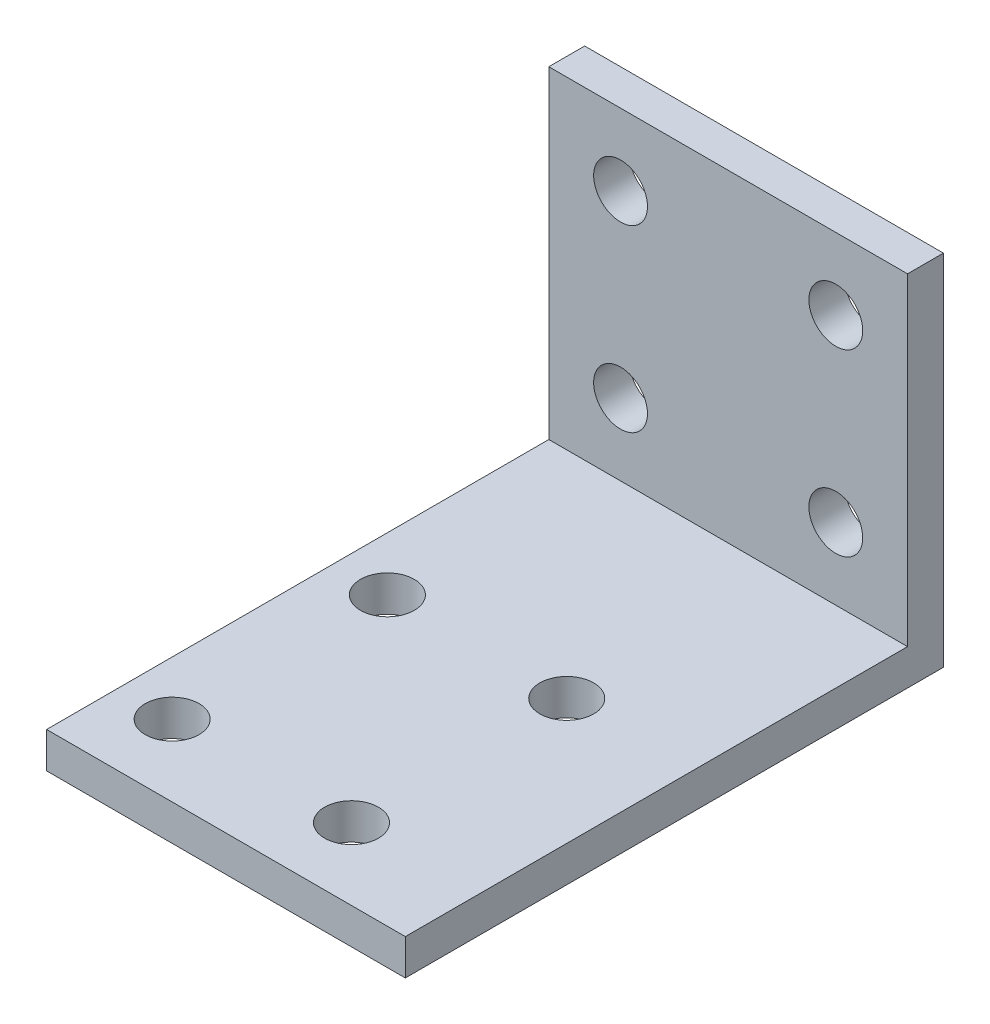
ISO-10303-21;
HEADER;
FILE_DESCRIPTION(('STEP AP214'),'2;1');
FILE_NAME('part.step','',(''),(''),'','','');
FILE_SCHEMA(('AUTOMOTIVE_DESIGN { 1 0 10303 214 1 1 1 1 }'));
ENDSEC;
DATA;
#1=APPLICATION_CONTEXT('core data for automotive mechanical design processes');
#2=APPLICATION_PROTOCOL_DEFINITION('international standard','automotive_design',2000,#1);
#3=PRODUCT_CONTEXT('',#1,'mechanical');
#4=PRODUCT('Part','Part','',(#3));
#5=PRODUCT_RELATED_PRODUCT_CATEGORY('part','',(#4));
#6=PRODUCT_DEFINITION_FORMATION('','',#4);
#7=PRODUCT_DEFINITION_CONTEXT('part definition',#1,'design');
#8=PRODUCT_DEFINITION('design','',#6,#7);
#9=PRODUCT_DEFINITION_SHAPE('','',#8);
#10=(LENGTH_UNIT() NAMED_UNIT(*) SI_UNIT(.MILLI.,.METRE.));
#11=(NAMED_UNIT(*) PLANE_ANGLE_UNIT() SI_UNIT($,.RADIAN.));
#12=(NAMED_UNIT(*) SI_UNIT($,.STERADIAN.) SOLID_ANGLE_UNIT());
#13=UNCERTAINTY_MEASURE_WITH_UNIT(LENGTH_MEASURE(1.E-05),#10,'distance_accuracy_value','');
#14=(GEOMETRIC_REPRESENTATION_CONTEXT(3) GLOBAL_UNCERTAINTY_ASSIGNED_CONTEXT((#13)) GLOBAL_UNIT_ASSIGNED_CONTEXT((#10,
#11,#12)) REPRESENTATION_CONTEXT('',''));
#15=CARTESIAN_POINT('',(0.,0.,0.));
#16=DIRECTION('',(0.,0.,1.));
#17=DIRECTION('',(1.,0.,0.));
#18=AXIS2_PLACEMENT_3D('',#15,#16,#17);
#19=CARTESIAN_POINT('',(0.,20.,0.));
#20=DIRECTION('',(0.,1.,0.));
#21=DIRECTION('',(0.,0.,1.));
#22=AXIS2_PLACEMENT_3D('',#19,#20,#21);
#23=PLANE('',#22);
#24=DIRECTION('',(0.,0.,1.));
#25=VECTOR('',#24,1.);
#26=CARTESIAN_POINT('',(-21.3353115727003,20.,-6.91394658753707));
#27=LINE('',#26,#25);
#28=CARTESIAN_POINT('',(-21.3353115727003,20.,-6.91394658753707));
#29=VERTEX_POINT('',#28);
#30=CARTESIAN_POINT('',(-21.3353115727003,20.,-4.91394658753707));
#31=VERTEX_POINT('',#30);
#32=EDGE_CURVE('E135',#29,#31,#27,.T.);
#33=ORIENTED_EDGE('',*,*,#32,.T.);
#34=DIRECTION('',(-1.,0.,0.));
#35=VECTOR('',#34,1.);
#36=CARTESIAN_POINT('',(-21.3353115727003,20.,-4.91394658753707));
#37=LINE('',#36,#35);
#38=CARTESIAN_POINT('',(-1.33531157270029,20.,-4.91394658753707));
#39=VERTEX_POINT('',#38);
#40=EDGE_CURVE('E100',#39,#31,#37,.T.);
#41=ORIENTED_EDGE('',*,*,#40,.F.);
#42=DIRECTION('',(0.,0.,1.));
#43=VECTOR('',#42,1.);
#44=CARTESIAN_POINT('',(-1.33531157270029,20.,0.));
#45=LINE('',#44,#43);
#46=CARTESIAN_POINT('',(-1.33531157270029,20.,-6.91394658753707));
#47=VERTEX_POINT('',#46);
#48=EDGE_CURVE('E99',#47,#39,#45,.T.);
#49=ORIENTED_EDGE('',*,*,#48,.F.);
#50=DIRECTION('',(-1.,0.,0.));
#51=VECTOR('',#50,1.);
#52=CARTESIAN_POINT('',(-21.3353115727003,20.,-6.91394658753707));
#53=LINE('',#52,#51);
#54=EDGE_CURVE('E138',#47,#29,#53,.T.);
#55=ORIENTED_EDGE('',*,*,#54,.T.);
#56=EDGE_LOOP('',(#33,#41,#49,#55));
#57=FACE_BOUND('',#56,.T.);
#58=ADVANCED_FACE('F39',(#57),#23,.T.);
#59=CARTESIAN_POINT('',(0.,0.,0.));
#60=DIRECTION('',(0.,1.,0.));
#61=DIRECTION('',(0.,0.,1.));
#62=AXIS2_PLACEMENT_3D('',#59,#60,#61);
#63=PLANE('',#62);
#64=CARTESIAN_POINT('',(-8.33531157270018,0.,19.0860534124648));
#65=DIRECTION('',(0.,-1.,0.));
#66=DIRECTION('',(0.,0.,-1.));
#67=AXIS2_PLACEMENT_3D('',#64,#65,#66);
#68=CIRCLE('',#67,1.5);
#69=CARTESIAN_POINT('',(-8.33531157270018,0.,17.5860534124648));
#70=VERTEX_POINT('',#69);
#71=EDGE_CURVE('E319',#70,#70,#68,.T.);
#72=ORIENTED_EDGE('',*,*,#71,.F.);
#73=EDGE_LOOP('',(#72));
#74=FACE_BOUND('',#73,.T.);
#75=CARTESIAN_POINT('',(-18.3353115727002,0.,7.08605341246484));
#76=DIRECTION('',(0.,-1.,0.));
#77=DIRECTION('',(0.,0.,-1.));
#78=AXIS2_PLACEMENT_3D('',#75,#76,#77);
#79=CIRCLE('',#78,1.5);
#80=CARTESIAN_POINT('',(-18.3353115727002,0.,5.58605341246483));
#81=VERTEX_POINT('',#80);
#82=EDGE_CURVE('E314',#81,#81,#79,.T.);
#83=ORIENTED_EDGE('',*,*,#82,.F.);
#84=EDGE_LOOP('',(#83));
#85=FACE_BOUND('',#84,.T.);
#86=CARTESIAN_POINT('',(-18.3353115727002,0.,19.0860534124648));
#87=DIRECTION('',(0.,-1.,0.));
#88=DIRECTION('',(0.,0.,-1.));
#89=AXIS2_PLACEMENT_3D('',#86,#87,#88);
#90=CIRCLE('',#89,1.5);
#91=CARTESIAN_POINT('',(-18.3353115727002,0.,17.5860534124648));
#92=VERTEX_POINT('',#91);
#93=EDGE_CURVE('E311',#92,#92,#90,.T.);
#94=ORIENTED_EDGE('',*,*,#93,.F.);
#95=EDGE_LOOP('',(#94));
#96=FACE_BOUND('',#95,.T.);
#97=CARTESIAN_POINT('',(-8.33531157270017,0.,7.08605341246484));
#98=DIRECTION('',(0.,-1.,0.));
#99=DIRECTION('',(0.,0.,-1.));
#100=AXIS2_PLACEMENT_3D('',#97,#98,#99);
#101=CIRCLE('',#100,1.5);
#102=CARTESIAN_POINT('',(-8.33531157270017,0.,5.58605341246483));
#103=VERTEX_POINT('',#102);
#104=EDGE_CURVE('E118',#103,#103,#101,.T.);
#105=ORIENTED_EDGE('',*,*,#104,.F.);
#106=EDGE_LOOP('',(#105));
#107=FACE_BOUND('',#106,.T.);
#108=DIRECTION('',(1.,0.,0.));
#109=VECTOR('',#108,1.);
#110=CARTESIAN_POINT('',(-21.3353115727003,0.,23.0860534124629));
#111=LINE('',#110,#109);
#112=CARTESIAN_POINT('',(-21.3353115727003,0.,23.0860534124629));
#113=VERTEX_POINT('',#112);
#114=CARTESIAN_POINT('',(-1.33531157270028,0.,23.0860534124629));
#115=VERTEX_POINT('',#114);
#116=EDGE_CURVE('E64',#113,#115,#111,.T.);
#117=ORIENTED_EDGE('',*,*,#116,.F.);
#118=DIRECTION('',(0.,0.,1.));
#119=VECTOR('',#118,1.);
#120=CARTESIAN_POINT('',(-21.3353115727003,0.,-6.91394658753707));
#121=LINE('',#120,#119);
#122=CARTESIAN_POINT('',(-21.3353115727003,0.,-6.91394658753707));
#123=VERTEX_POINT('',#122);
#124=EDGE_CURVE('E140',#123,#113,#121,.T.);
#125=ORIENTED_EDGE('',*,*,#124,.F.);
#126=DIRECTION('',(-1.,0.,0.));
#127=VECTOR('',#126,1.);
#128=CARTESIAN_POINT('',(-21.3353115727003,0.,-6.91394658753707));
#129=LINE('',#128,#127);
#130=CARTESIAN_POINT('',(-1.33531157270029,0.,-6.91394658753707));
#131=VERTEX_POINT('',#130);
#132=EDGE_CURVE('E48',#131,#123,#129,.T.);
#133=ORIENTED_EDGE('',*,*,#132,.F.);
#134=DIRECTION('',(0.,0.,-1.));
#135=VECTOR('',#134,1.);
#136=CARTESIAN_POINT('',(-1.33531157270029,0.,0.));
#137=LINE('',#136,#135);
#138=EDGE_CURVE('E130',#115,#131,#137,.T.);
#139=ORIENTED_EDGE('',*,*,#138,.F.);
#140=EDGE_LOOP('',(#117,#125,#133,#139));
#141=FACE_BOUND('',#140,.T.);
#142=ADVANCED_FACE('F173',(#74,#85,#96,#107,#141),#63,.F.);
#143=CARTESIAN_POINT('',(-21.3353115727003,3.,-6.91394658753707));
#144=DIRECTION('',(1.,0.,0.));
#145=DIRECTION('',(0.,0.,-1.));
#146=AXIS2_PLACEMENT_3D('',#143,#144,#145);
#147=PLANE('',#146);
#148=DIRECTION('',(0.,0.,1.));
#149=VECTOR('',#148,1.);
#150=CARTESIAN_POINT('',(-21.3353115727003,2.,-4.91394658753707));
#151=LINE('',#150,#149);
#152=CARTESIAN_POINT('',(-21.3353115727003,2.,-4.91394658753707));
#153=VERTEX_POINT('',#152);
#154=CARTESIAN_POINT('',(-21.3353115727003,2.,23.0860534124629));
#155=VERTEX_POINT('',#154);
#156=EDGE_CURVE('E109',#153,#155,#151,.T.);
#157=ORIENTED_EDGE('',*,*,#156,.F.);
#158=DIRECTION('',(0.,-1.,0.));
#159=VECTOR('',#158,1.);
#160=CARTESIAN_POINT('',(-21.3353115727003,20.,-4.91394658753707));
#161=LINE('',#160,#159);
#162=EDGE_CURVE('E101',#31,#153,#161,.T.);
#163=ORIENTED_EDGE('',*,*,#162,.F.);
#164=ORIENTED_EDGE('',*,*,#32,.F.);
#165=DIRECTION('',(0.,-1.,0.));
#166=VECTOR('',#165,1.);
#167=CARTESIAN_POINT('',(-21.3353115727003,3.,-6.91394658753707));
#168=LINE('',#167,#166);
#169=EDGE_CURVE('E11',#29,#123,#168,.T.);
#170=ORIENTED_EDGE('',*,*,#169,.T.);
#171=ORIENTED_EDGE('',*,*,#124,.T.);
#172=DIRECTION('',(0.,-1.,0.));
#173=VECTOR('',#172,1.);
#174=CARTESIAN_POINT('',(-21.3353115727003,3.,23.0860534124629));
#175=LINE('',#174,#173);
#176=EDGE_CURVE('E125',#155,#113,#175,.T.);
#177=ORIENTED_EDGE('',*,*,#176,.F.);
#178=EDGE_LOOP('',(#157,#163,#164,#170,#171,#177));
#179=FACE_BOUND('',#178,.T.);
#180=ADVANCED_FACE('F41',(#179),#147,.F.);
#181=CARTESIAN_POINT('',(-1.33531157270029,0.,0.));
#182=DIRECTION('',(1.,0.,0.));
#183=DIRECTION('',(0.,0.,-1.));
#184=AXIS2_PLACEMENT_3D('',#181,#182,#183);
#185=PLANE('',#184);
#186=DIRECTION('',(0.,1.,0.));
#187=VECTOR('',#186,1.);
#188=CARTESIAN_POINT('',(-1.33531157270029,20.,-4.91394658753707));
#189=LINE('',#188,#187);
#190=CARTESIAN_POINT('',(-1.33531157270029,2.,-4.91394658753707));
#191=VERTEX_POINT('',#190);
#192=EDGE_CURVE('E56',#191,#39,#189,.T.);
#193=ORIENTED_EDGE('',*,*,#192,.F.);
#194=DIRECTION('',(0.,0.,-1.));
#195=VECTOR('',#194,1.);
#196=CARTESIAN_POINT('',(-1.33531157270029,2.,-4.91394658753707));
#197=LINE('',#196,#195);
#198=CARTESIAN_POINT('',(-1.33531157270029,2.,23.0860534124629));
#199=VERTEX_POINT('',#198);
#200=EDGE_CURVE('E97',#199,#191,#197,.T.);
#201=ORIENTED_EDGE('',*,*,#200,.F.);
#202=DIRECTION('',(0.,1.,0.));
#203=VECTOR('',#202,1.);
#204=CARTESIAN_POINT('',(-1.33531157270028,3.,23.0860534124629));
#205=LINE('',#204,#203);
#206=EDGE_CURVE('E128',#115,#199,#205,.T.);
#207=ORIENTED_EDGE('',*,*,#206,.F.);
#208=ORIENTED_EDGE('',*,*,#138,.T.);
#209=DIRECTION('',(0.,1.,0.));
#210=VECTOR('',#209,1.);
#211=CARTESIAN_POINT('',(-1.33531157270029,0.,-6.91394658753707));
#212=LINE('',#211,#210);
#213=EDGE_CURVE('E132',#131,#47,#212,.T.);
#214=ORIENTED_EDGE('',*,*,#213,.T.);
#215=ORIENTED_EDGE('',*,*,#48,.T.);
#216=EDGE_LOOP('',(#193,#201,#207,#208,#214,#215));
#217=FACE_BOUND('',#216,.T.);
#218=ADVANCED_FACE('F95',(#217),#185,.T.);
#219=CARTESIAN_POINT('',(-21.3353115727003,3.,-6.91394658753707));
#220=DIRECTION('',(0.,0.,1.));
#221=DIRECTION('',(1.,0.,0.));
#222=AXIS2_PLACEMENT_3D('',#219,#220,#221);
#223=PLANE('',#222);
#224=CARTESIAN_POINT('',(-17.3353115727003,6.,-6.91394658753707));
#225=DIRECTION('',(0.,0.,1.));
#226=DIRECTION('',(1.,0.,0.));
#227=AXIS2_PLACEMENT_3D('',#224,#225,#226);
#228=CIRCLE('',#227,1.5);
#229=CARTESIAN_POINT('',(-15.8353115727003,6.,-6.91394658753707));
#230=VERTEX_POINT('',#229);
#231=EDGE_CURVE('E197',#230,#230,#228,.T.);
#232=ORIENTED_EDGE('',*,*,#231,.T.);
#233=EDGE_LOOP('',(#232));
#234=FACE_BOUND('',#233,.T.);
#235=CARTESIAN_POINT('',(-5.33531157270029,16.,-6.91394658753707));
#236=DIRECTION('',(0.,0.,1.));
#237=DIRECTION('',(1.,0.,0.));
#238=AXIS2_PLACEMENT_3D('',#235,#236,#237);
#239=CIRCLE('',#238,1.5);
#240=CARTESIAN_POINT('',(-3.83531157270028,16.,-6.91394658753707));
#241=VERTEX_POINT('',#240);
#242=EDGE_CURVE('E201',#241,#241,#239,.T.);
#243=ORIENTED_EDGE('',*,*,#242,.T.);
#244=EDGE_LOOP('',(#243));
#245=FACE_BOUND('',#244,.T.);
#246=CARTESIAN_POINT('',(-17.3353115727003,16.,-6.91394658753707));
#247=DIRECTION('',(0.,0.,1.));
#248=DIRECTION('',(1.,0.,0.));
#249=AXIS2_PLACEMENT_3D('',#246,#247,#248);
#250=CIRCLE('',#249,1.5);
#251=CARTESIAN_POINT('',(-15.8353115727003,16.,-6.91394658753707));
#252=VERTEX_POINT('',#251);
#253=EDGE_CURVE('E205',#252,#252,#250,.T.);
#254=ORIENTED_EDGE('',*,*,#253,.T.);
#255=EDGE_LOOP('',(#254));
#256=FACE_BOUND('',#255,.T.);
#257=CARTESIAN_POINT('',(-5.33531157270029,6.,-6.91394658753707));
#258=DIRECTION('',(0.,0.,1.));
#259=DIRECTION('',(1.,0.,0.));
#260=AXIS2_PLACEMENT_3D('',#257,#258,#259);
#261=CIRCLE('',#260,1.5);
#262=CARTESIAN_POINT('',(-3.83531157270028,6.,-6.91394658753707));
#263=VERTEX_POINT('',#262);
#264=EDGE_CURVE('E209',#263,#263,#261,.T.);
#265=ORIENTED_EDGE('',*,*,#264,.T.);
#266=EDGE_LOOP('',(#265));
#267=FACE_BOUND('',#266,.T.);
#268=ORIENTED_EDGE('',*,*,#213,.F.);
#269=ORIENTED_EDGE('',*,*,#132,.T.);
#270=ORIENTED_EDGE('',*,*,#169,.F.);
#271=ORIENTED_EDGE('',*,*,#54,.F.);
#272=EDGE_LOOP('',(#268,#269,#270,#271));
#273=FACE_BOUND('',#272,.T.);
#274=ADVANCED_FACE('F184',(#234,#245,#256,#267,#273),#223,.F.);
#275=CARTESIAN_POINT('',(0.,0.,23.0860534124629));
#276=DIRECTION('',(0.,0.,1.));
#277=DIRECTION('',(1.,0.,0.));
#278=AXIS2_PLACEMENT_3D('',#275,#276,#277);
#279=PLANE('',#278);
#280=DIRECTION('',(1.,0.,0.));
#281=VECTOR('',#280,1.);
#282=CARTESIAN_POINT('',(-1.33531157270029,2.,23.0860534124629));
#283=LINE('',#282,#281);
#284=EDGE_CURVE('E113',#155,#199,#283,.T.);
#285=ORIENTED_EDGE('',*,*,#284,.F.);
#286=ORIENTED_EDGE('',*,*,#176,.T.);
#287=ORIENTED_EDGE('',*,*,#116,.T.);
#288=ORIENTED_EDGE('',*,*,#206,.T.);
#289=EDGE_LOOP('',(#285,#286,#287,#288));
#290=FACE_BOUND('',#289,.T.);
#291=ADVANCED_FACE('F186',(#290),#279,.T.);
#292=CARTESIAN_POINT('',(0.,0.,-4.91394658753707));
#293=DIRECTION('',(0.,0.,1.));
#294=DIRECTION('',(1.,0.,0.));
#295=AXIS2_PLACEMENT_3D('',#292,#293,#294);
#296=PLANE('',#295);
#297=CARTESIAN_POINT('',(-17.3353115727003,6.,-4.91394658753707));
#298=DIRECTION('',(0.,0.,1.));
#299=DIRECTION('',(1.,0.,0.));
#300=AXIS2_PLACEMENT_3D('',#297,#298,#299);
#301=CIRCLE('',#300,1.5);
#302=CARTESIAN_POINT('',(-15.8353115727003,6.,-4.91394658753707));
#303=VERTEX_POINT('',#302);
#304=EDGE_CURVE('E310',#303,#303,#301,.T.);
#305=ORIENTED_EDGE('',*,*,#304,.F.);
#306=EDGE_LOOP('',(#305));
#307=FACE_BOUND('',#306,.T.);
#308=CARTESIAN_POINT('',(-5.33531157270029,16.,-4.91394658753707));
#309=DIRECTION('',(0.,0.,1.));
#310=DIRECTION('',(1.,0.,0.));
#311=AXIS2_PLACEMENT_3D('',#308,#309,#310);
#312=CIRCLE('',#311,1.5);
#313=CARTESIAN_POINT('',(-3.83531157270028,16.,-4.91394658753707));
#314=VERTEX_POINT('',#313);
#315=EDGE_CURVE('E341',#314,#314,#312,.T.);
#316=ORIENTED_EDGE('',*,*,#315,.F.);
#317=EDGE_LOOP('',(#316));
#318=FACE_BOUND('',#317,.T.);
#319=CARTESIAN_POINT('',(-17.3353115727003,16.,-4.91394658753707));
#320=DIRECTION('',(0.,0.,1.));
#321=DIRECTION('',(1.,0.,0.));
#322=AXIS2_PLACEMENT_3D('',#319,#320,#321);
#323=CIRCLE('',#322,1.5);
#324=CARTESIAN_POINT('',(-15.8353115727003,16.,-4.91394658753707));
#325=VERTEX_POINT('',#324);
#326=EDGE_CURVE('E344',#325,#325,#323,.T.);
#327=ORIENTED_EDGE('',*,*,#326,.F.);
#328=EDGE_LOOP('',(#327));
#329=FACE_BOUND('',#328,.T.);
#330=CARTESIAN_POINT('',(-5.33531157270029,6.,-4.91394658753707));
#331=DIRECTION('',(0.,0.,1.));
#332=DIRECTION('',(1.,0.,0.));
#333=AXIS2_PLACEMENT_3D('',#330,#331,#332);
#334=CIRCLE('',#333,1.5);
#335=CARTESIAN_POINT('',(-3.83531157270028,6.,-4.91394658753707));
#336=VERTEX_POINT('',#335);
#337=EDGE_CURVE('E338',#336,#336,#334,.T.);
#338=ORIENTED_EDGE('',*,*,#337,.F.);
#339=EDGE_LOOP('',(#338));
#340=FACE_BOUND('',#339,.T.);
#341=ORIENTED_EDGE('',*,*,#162,.T.);
#342=DIRECTION('',(-1.,0.,0.));
#343=VECTOR('',#342,1.);
#344=CARTESIAN_POINT('',(-1.33531157270029,2.,-4.91394658753707));
#345=LINE('',#344,#343);
#346=EDGE_CURVE('E104',#191,#153,#345,.T.);
#347=ORIENTED_EDGE('',*,*,#346,.F.);
#348=ORIENTED_EDGE('',*,*,#192,.T.);
#349=ORIENTED_EDGE('',*,*,#40,.T.);
#350=EDGE_LOOP('',(#341,#347,#348,#349));
#351=FACE_BOUND('',#350,.T.);
#352=ADVANCED_FACE('F105',(#307,#318,#329,#340,#351),#296,.T.);
#353=CARTESIAN_POINT('',(0.,2.,0.));
#354=DIRECTION('',(0.,-1.,0.));
#355=DIRECTION('',(0.,0.,-1.));
#356=AXIS2_PLACEMENT_3D('',#353,#354,#355);
#357=PLANE('',#356);
#358=CARTESIAN_POINT('',(-8.33531157270018,2.,19.0860534124648));
#359=DIRECTION('',(0.,-1.,0.));
#360=DIRECTION('',(0.,0.,-1.));
#361=AXIS2_PLACEMENT_3D('',#358,#359,#360);
#362=CIRCLE('',#361,1.5);
#363=CARTESIAN_POINT('',(-8.33531157270018,2.,17.5860534124648));
#364=VERTEX_POINT('',#363);
#365=EDGE_CURVE('E43',#364,#364,#362,.T.);
#366=ORIENTED_EDGE('',*,*,#365,.T.);
#367=EDGE_LOOP('',(#366));
#368=FACE_BOUND('',#367,.T.);
#369=CARTESIAN_POINT('',(-18.3353115727002,2.,7.08605341246484));
#370=DIRECTION('',(0.,-1.,0.));
#371=DIRECTION('',(0.,0.,-1.));
#372=AXIS2_PLACEMENT_3D('',#369,#370,#371);
#373=CIRCLE('',#372,1.5);
#374=CARTESIAN_POINT('',(-18.3353115727002,2.,5.58605341246483));
#375=VERTEX_POINT('',#374);
#376=EDGE_CURVE('E116',#375,#375,#373,.T.);
#377=ORIENTED_EDGE('',*,*,#376,.T.);
#378=EDGE_LOOP('',(#377));
#379=FACE_BOUND('',#378,.T.);
#380=CARTESIAN_POINT('',(-18.3353115727002,2.,19.0860534124648));
#381=DIRECTION('',(0.,-1.,0.));
#382=DIRECTION('',(0.,0.,-1.));
#383=AXIS2_PLACEMENT_3D('',#380,#381,#382);
#384=CIRCLE('',#383,1.5);
#385=CARTESIAN_POINT('',(-18.3353115727002,2.,17.5860534124648));
#386=VERTEX_POINT('',#385);
#387=EDGE_CURVE('E147',#386,#386,#384,.T.);
#388=ORIENTED_EDGE('',*,*,#387,.T.);
#389=EDGE_LOOP('',(#388));
#390=FACE_BOUND('',#389,.T.);
#391=CARTESIAN_POINT('',(-8.33531157270017,2.,7.08605341246484));
#392=DIRECTION('',(0.,-1.,0.));
#393=DIRECTION('',(0.,0.,-1.));
#394=AXIS2_PLACEMENT_3D('',#391,#392,#393);
#395=CIRCLE('',#394,1.5);
#396=CARTESIAN_POINT('',(-8.33531157270017,2.,5.58605341246483));
#397=VERTEX_POINT('',#396);
#398=EDGE_CURVE('E144',#397,#397,#395,.T.);
#399=ORIENTED_EDGE('',*,*,#398,.T.);
#400=EDGE_LOOP('',(#399));
#401=FACE_BOUND('',#400,.T.);
#402=ORIENTED_EDGE('',*,*,#200,.T.);
#403=ORIENTED_EDGE('',*,*,#346,.T.);
#404=ORIENTED_EDGE('',*,*,#156,.T.);
#405=ORIENTED_EDGE('',*,*,#284,.T.);
#406=EDGE_LOOP('',(#402,#403,#404,#405));
#407=FACE_BOUND('',#406,.T.);
#408=ADVANCED_FACE('F111',(#368,#379,#390,#401,#407),#357,.F.);
#409=CARTESIAN_POINT('',(-8.33531157270017,10.,7.08605341246484));
#410=DIRECTION('',(0.,-1.,0.));
#411=DIRECTION('',(0.,0.,-1.));
#412=AXIS2_PLACEMENT_3D('',#409,#410,#411);
#413=CYLINDRICAL_SURFACE('',#412,1.5);
#414=ORIENTED_EDGE('',*,*,#104,.T.);
#415=EDGE_LOOP('',(#414));
#416=FACE_BOUND('',#415,.T.);
#417=ORIENTED_EDGE('',*,*,#398,.F.);
#418=EDGE_LOOP('',(#417));
#419=FACE_BOUND('',#418,.T.);
#420=ADVANCED_FACE('F167',(#416,#419),#413,.F.);
#421=CARTESIAN_POINT('',(-18.3353115727002,10.,19.0860534124648));
#422=DIRECTION('',(0.,-1.,0.));
#423=DIRECTION('',(0.,0.,-1.));
#424=AXIS2_PLACEMENT_3D('',#421,#422,#423);
#425=CYLINDRICAL_SURFACE('',#424,1.5);
#426=ORIENTED_EDGE('',*,*,#93,.T.);
#427=EDGE_LOOP('',(#426));
#428=FACE_BOUND('',#427,.T.);
#429=ORIENTED_EDGE('',*,*,#387,.F.);
#430=EDGE_LOOP('',(#429));
#431=FACE_BOUND('',#430,.T.);
#432=ADVANCED_FACE('F157',(#428,#431),#425,.F.);
#433=CARTESIAN_POINT('',(-18.3353115727002,10.,7.08605341246484));
#434=DIRECTION('',(0.,-1.,0.));
#435=DIRECTION('',(0.,0.,-1.));
#436=AXIS2_PLACEMENT_3D('',#433,#434,#435);
#437=CYLINDRICAL_SURFACE('',#436,1.5);
#438=ORIENTED_EDGE('',*,*,#82,.T.);
#439=EDGE_LOOP('',(#438));
#440=FACE_BOUND('',#439,.T.);
#441=ORIENTED_EDGE('',*,*,#376,.F.);
#442=EDGE_LOOP('',(#441));
#443=FACE_BOUND('',#442,.T.);
#444=ADVANCED_FACE('F154',(#440,#443),#437,.F.);
#445=CARTESIAN_POINT('',(-8.33531157270018,10.,19.0860534124648));
#446=DIRECTION('',(0.,-1.,0.));
#447=DIRECTION('',(0.,0.,-1.));
#448=AXIS2_PLACEMENT_3D('',#445,#446,#447);
#449=CYLINDRICAL_SURFACE('',#448,1.5);
#450=ORIENTED_EDGE('',*,*,#71,.T.);
#451=EDGE_LOOP('',(#450));
#452=FACE_BOUND('',#451,.T.);
#453=ORIENTED_EDGE('',*,*,#365,.F.);
#454=EDGE_LOOP('',(#453));
#455=FACE_BOUND('',#454,.T.);
#456=ADVANCED_FACE('F156',(#452,#455),#449,.F.);
#457=CARTESIAN_POINT('',(-5.33531157270029,6.,-14.9139465875371));
#458=DIRECTION('',(0.,0.,1.));
#459=DIRECTION('',(1.,0.,0.));
#460=AXIS2_PLACEMENT_3D('',#457,#458,#459);
#461=CYLINDRICAL_SURFACE('',#460,1.5);
#462=ORIENTED_EDGE('',*,*,#337,.T.);
#463=EDGE_LOOP('',(#462));
#464=FACE_BOUND('',#463,.T.);
#465=ORIENTED_EDGE('',*,*,#264,.F.);
#466=EDGE_LOOP('',(#465));
#467=FACE_BOUND('',#466,.T.);
#468=ADVANCED_FACE('F164',(#464,#467),#461,.F.);
#469=CARTESIAN_POINT('',(-17.3353115727003,16.,-14.9139465875371));
#470=DIRECTION('',(0.,0.,1.));
#471=DIRECTION('',(1.,0.,0.));
#472=AXIS2_PLACEMENT_3D('',#469,#470,#471);
#473=CYLINDRICAL_SURFACE('',#472,1.5);
#474=ORIENTED_EDGE('',*,*,#326,.T.);
#475=EDGE_LOOP('',(#474));
#476=FACE_BOUND('',#475,.T.);
#477=ORIENTED_EDGE('',*,*,#253,.F.);
#478=EDGE_LOOP('',(#477));
#479=FACE_BOUND('',#478,.T.);
#480=ADVANCED_FACE('F273',(#476,#479),#473,.F.);
#481=CARTESIAN_POINT('',(-5.33531157270029,16.,-14.9139465875371));
#482=DIRECTION('',(0.,0.,1.));
#483=DIRECTION('',(1.,0.,0.));
#484=AXIS2_PLACEMENT_3D('',#481,#482,#483);
#485=CYLINDRICAL_SURFACE('',#484,1.5);
#486=ORIENTED_EDGE('',*,*,#315,.T.);
#487=EDGE_LOOP('',(#486));
#488=FACE_BOUND('',#487,.T.);
#489=ORIENTED_EDGE('',*,*,#242,.F.);
#490=EDGE_LOOP('',(#489));
#491=FACE_BOUND('',#490,.T.);
#492=ADVANCED_FACE('F280',(#488,#491),#485,.F.);
#493=CARTESIAN_POINT('',(-17.3353115727003,6.,-14.9139465875371));
#494=DIRECTION('',(0.,0.,1.));
#495=DIRECTION('',(1.,0.,0.));
#496=AXIS2_PLACEMENT_3D('',#493,#494,#495);
#497=CYLINDRICAL_SURFACE('',#496,1.5);
#498=ORIENTED_EDGE('',*,*,#304,.T.);
#499=EDGE_LOOP('',(#498));
#500=FACE_BOUND('',#499,.T.);
#501=ORIENTED_EDGE('',*,*,#231,.F.);
#502=EDGE_LOOP('',(#501));
#503=FACE_BOUND('',#502,.T.);
#504=ADVANCED_FACE('F288',(#500,#503),#497,.F.);
#505=CLOSED_SHELL('',(#58,#142,#180,#218,#274,#291,#352,#408,#420,#432,#444,#456,#468,#480,#492,#504));
#506=MANIFOLD_SOLID_BREP('B2',#505);
#507=ADVANCED_BREP_SHAPE_REPRESENTATION('',(#18,#506),#14);
#508=SHAPE_DEFINITION_REPRESENTATION(#9,#507);
ENDSEC;
END-ISO-10303-21;
